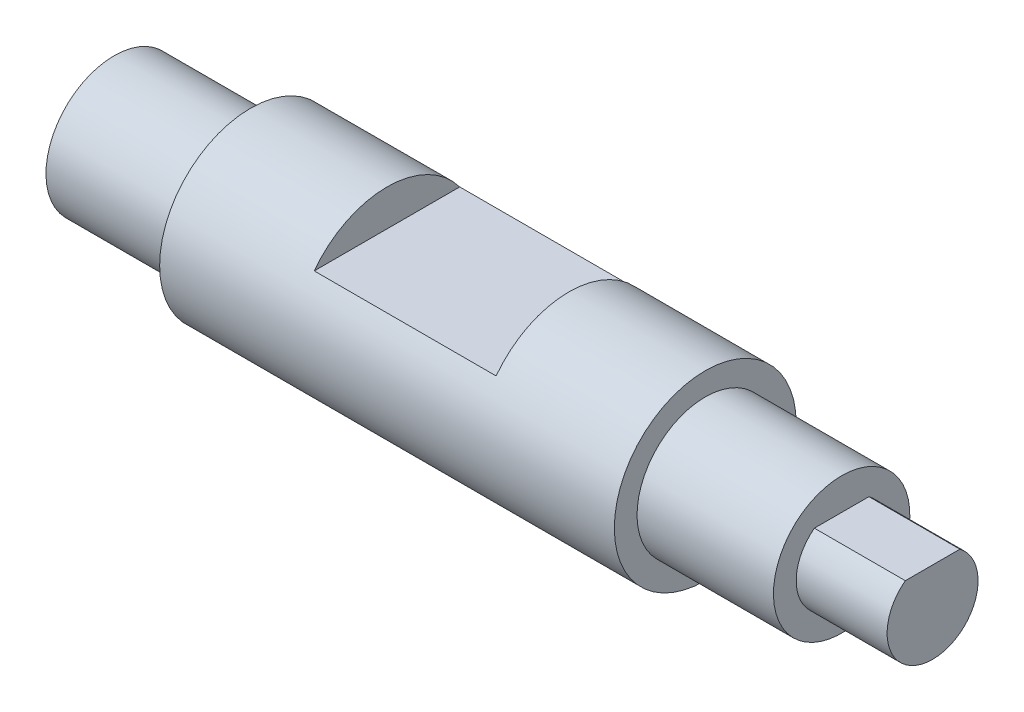
ISO-10303-21;
HEADER;
FILE_DESCRIPTION(('STEP AP214'),'2;1');
FILE_NAME('part.step','',(''),(''),'','','');
FILE_SCHEMA(('AUTOMOTIVE_DESIGN { 1 0 10303 214 1 1 1 1 }'));
ENDSEC;
DATA;
#1=APPLICATION_CONTEXT('core data for automotive mechanical design processes');
#2=APPLICATION_PROTOCOL_DEFINITION('international standard','automotive_design',2000,#1);
#3=PRODUCT_CONTEXT('',#1,'mechanical');
#4=PRODUCT('Part','Part','',(#3));
#5=PRODUCT_RELATED_PRODUCT_CATEGORY('part','',(#4));
#6=PRODUCT_DEFINITION_FORMATION('','',#4);
#7=PRODUCT_DEFINITION_CONTEXT('part definition',#1,'design');
#8=PRODUCT_DEFINITION('design','',#6,#7);
#9=PRODUCT_DEFINITION_SHAPE('','',#8);
#10=(LENGTH_UNIT() NAMED_UNIT(*) SI_UNIT(.MILLI.,.METRE.));
#11=(NAMED_UNIT(*) PLANE_ANGLE_UNIT() SI_UNIT($,.RADIAN.));
#12=(NAMED_UNIT(*) SI_UNIT($,.STERADIAN.) SOLID_ANGLE_UNIT());
#13=UNCERTAINTY_MEASURE_WITH_UNIT(LENGTH_MEASURE(1.E-05),#10,'distance_accuracy_value','');
#14=(GEOMETRIC_REPRESENTATION_CONTEXT(3) GLOBAL_UNCERTAINTY_ASSIGNED_CONTEXT((#13)) GLOBAL_UNIT_ASSIGNED_CONTEXT((#10,
#11,#12)) REPRESENTATION_CONTEXT('',''));
#15=CARTESIAN_POINT('',(0.,0.,0.));
#16=DIRECTION('',(0.,0.,1.));
#17=DIRECTION('',(1.,0.,0.));
#18=AXIS2_PLACEMENT_3D('',#15,#16,#17);
#19=CARTESIAN_POINT('',(0.,0.,0.));
#20=DIRECTION('',(-1.,0.,0.));
#21=DIRECTION('',(0.,-1.,0.));
#22=AXIS2_PLACEMENT_3D('',#19,#20,#21);
#23=PLANE('',#22);
#24=CARTESIAN_POINT('',(0.,0.,0.));
#25=DIRECTION('',(1.,0.,0.));
#26=DIRECTION('',(0.,1.,0.));
#27=AXIS2_PLACEMENT_3D('',#24,#25,#26);
#28=CIRCLE('',#27,7.5);
#29=CARTESIAN_POINT('',(0.,7.5,0.));
#30=VERTEX_POINT('',#29);
#31=EDGE_CURVE('E106',#30,#30,#28,.T.);
#32=ORIENTED_EDGE('',*,*,#31,.F.);
#33=EDGE_LOOP('',(#32));
#34=FACE_BOUND('',#33,.T.);
#35=ADVANCED_FACE('F32',(#34),#23,.T.);
#36=CARTESIAN_POINT('',(90.,0.,0.));
#37=DIRECTION('',(1.,0.,0.));
#38=DIRECTION('',(0.,1.,0.));
#39=AXIS2_PLACEMENT_3D('',#36,#37,#38);
#40=CYLINDRICAL_SURFACE('',#39,7.5);
#41=ORIENTED_EDGE('',*,*,#31,.T.);
#42=EDGE_LOOP('',(#41));
#43=FACE_BOUND('',#42,.T.);
#44=CARTESIAN_POINT('',(15.,0.,0.));
#45=DIRECTION('',(1.,0.,0.));
#46=DIRECTION('',(0.,1.,0.));
#47=AXIS2_PLACEMENT_3D('',#44,#45,#46);
#48=CIRCLE('',#47,7.5);
#49=CARTESIAN_POINT('',(15.,7.5,0.));
#50=VERTEX_POINT('',#49);
#51=EDGE_CURVE('E103',#50,#50,#48,.T.);
#52=ORIENTED_EDGE('',*,*,#51,.F.);
#53=EDGE_LOOP('',(#52));
#54=FACE_BOUND('',#53,.T.);
#55=ADVANCED_FACE('F141',(#43,#54),#40,.T.);
#56=CARTESIAN_POINT('',(15.,7.5,0.));
#57=DIRECTION('',(-1.,0.,0.));
#58=DIRECTION('',(0.,-1.,0.));
#59=AXIS2_PLACEMENT_3D('',#56,#57,#58);
#60=PLANE('',#59);
#61=ORIENTED_EDGE('',*,*,#51,.T.);
#62=EDGE_LOOP('',(#61));
#63=FACE_BOUND('',#62,.T.);
#64=CARTESIAN_POINT('',(15.,0.,0.));
#65=DIRECTION('',(1.,0.,0.));
#66=DIRECTION('',(0.,1.,0.));
#67=AXIS2_PLACEMENT_3D('',#64,#65,#66);
#68=CIRCLE('',#67,9.99999999999999);
#69=CARTESIAN_POINT('',(15.,9.99999999999999,0.));
#70=VERTEX_POINT('',#69);
#71=EDGE_CURVE('E100',#70,#70,#68,.T.);
#72=ORIENTED_EDGE('',*,*,#71,.F.);
#73=EDGE_LOOP('',(#72));
#74=FACE_BOUND('',#73,.T.);
#75=ADVANCED_FACE('F146',(#63,#74),#60,.T.);
#76=CARTESIAN_POINT('',(90.,0.,0.));
#77=DIRECTION('',(1.,0.,0.));
#78=DIRECTION('',(0.,1.,0.));
#79=AXIS2_PLACEMENT_3D('',#76,#77,#78);
#80=CYLINDRICAL_SURFACE('',#79,9.99999999999999);
#81=DIRECTION('',(1.,0.,0.));
#82=VECTOR('',#81,1.);
#83=CARTESIAN_POINT('',(90.,6.,-7.99999999999999));
#84=LINE('',#83,#82);
#85=CARTESIAN_POINT('',(50.,6.,-7.99999999999999));
#86=VERTEX_POINT('',#85);
#87=CARTESIAN_POINT('',(30.,6.,-7.99999999999999));
#88=VERTEX_POINT('',#87);
#89=EDGE_CURVE('E39',#86,#88,#84,.F.);
#90=ORIENTED_EDGE('',*,*,#89,.F.);
#91=CARTESIAN_POINT('',(50.,0.,0.));
#92=DIRECTION('',(1.,0.,0.));
#93=DIRECTION('',(0.,1.,0.));
#94=AXIS2_PLACEMENT_3D('',#91,#92,#93);
#95=CIRCLE('',#94,9.99999999999999);
#96=CARTESIAN_POINT('',(50.,6.,7.99999999999999));
#97=VERTEX_POINT('',#96);
#98=EDGE_CURVE('E111',#97,#86,#95,.F.);
#99=ORIENTED_EDGE('',*,*,#98,.F.);
#100=DIRECTION('',(1.,0.,0.));
#101=VECTOR('',#100,1.);
#102=CARTESIAN_POINT('',(90.,6.,7.99999999999999));
#103=LINE('',#102,#101);
#104=CARTESIAN_POINT('',(30.,6.,7.99999999999999));
#105=VERTEX_POINT('',#104);
#106=EDGE_CURVE('E109',#105,#97,#103,.T.);
#107=ORIENTED_EDGE('',*,*,#106,.F.);
#108=CARTESIAN_POINT('',(30.,0.,0.));
#109=DIRECTION('',(-1.,0.,0.));
#110=DIRECTION('',(0.,-1.,0.));
#111=AXIS2_PLACEMENT_3D('',#108,#109,#110);
#112=CIRCLE('',#111,9.99999999999999);
#113=EDGE_CURVE('E113',#88,#105,#112,.F.);
#114=ORIENTED_EDGE('',*,*,#113,.F.);
#115=EDGE_LOOP('',(#90,#99,#107,#114));
#116=FACE_BOUND('',#115,.T.);
#117=ORIENTED_EDGE('',*,*,#71,.T.);
#118=EDGE_LOOP('',(#117));
#119=FACE_BOUND('',#118,.T.);
#120=CARTESIAN_POINT('',(65.,0.,0.));
#121=DIRECTION('',(1.,0.,0.));
#122=DIRECTION('',(0.,1.,0.));
#123=AXIS2_PLACEMENT_3D('',#120,#121,#122);
#124=CIRCLE('',#123,9.99999999999999);
#125=CARTESIAN_POINT('',(65.,9.99999999999999,0.));
#126=VERTEX_POINT('',#125);
#127=EDGE_CURVE('E97',#126,#126,#124,.T.);
#128=ORIENTED_EDGE('',*,*,#127,.F.);
#129=EDGE_LOOP('',(#128));
#130=FACE_BOUND('',#129,.T.);
#131=ADVANCED_FACE('F124',(#116,#119,#130),#80,.T.);
#132=CARTESIAN_POINT('',(65.,9.99999999999999,0.));
#133=DIRECTION('',(1.,0.,0.));
#134=DIRECTION('',(0.,1.,0.));
#135=AXIS2_PLACEMENT_3D('',#132,#133,#134);
#136=PLANE('',#135);
#137=ORIENTED_EDGE('',*,*,#127,.T.);
#138=EDGE_LOOP('',(#137));
#139=FACE_BOUND('',#138,.T.);
#140=CARTESIAN_POINT('',(65.,0.,0.));
#141=DIRECTION('',(1.,0.,0.));
#142=DIRECTION('',(0.,1.,0.));
#143=AXIS2_PLACEMENT_3D('',#140,#141,#142);
#144=CIRCLE('',#143,7.5);
#145=CARTESIAN_POINT('',(65.,7.5,0.));
#146=VERTEX_POINT('',#145);
#147=EDGE_CURVE('E89',#146,#146,#144,.T.);
#148=ORIENTED_EDGE('',*,*,#147,.F.);
#149=EDGE_LOOP('',(#148));
#150=FACE_BOUND('',#149,.T.);
#151=ADVANCED_FACE('F158',(#139,#150),#136,.T.);
#152=CARTESIAN_POINT('',(90.,0.,0.));
#153=DIRECTION('',(1.,0.,0.));
#154=DIRECTION('',(0.,1.,0.));
#155=AXIS2_PLACEMENT_3D('',#152,#153,#154);
#156=CYLINDRICAL_SURFACE('',#155,7.5);
#157=ORIENTED_EDGE('',*,*,#147,.T.);
#158=EDGE_LOOP('',(#157));
#159=FACE_BOUND('',#158,.T.);
#160=CARTESIAN_POINT('',(80.,0.,0.));
#161=DIRECTION('',(1.,0.,0.));
#162=DIRECTION('',(0.,1.,0.));
#163=AXIS2_PLACEMENT_3D('',#160,#161,#162);
#164=CIRCLE('',#163,7.5);
#165=CARTESIAN_POINT('',(80.,7.5,0.));
#166=VERTEX_POINT('',#165);
#167=EDGE_CURVE('E85',#166,#166,#164,.T.);
#168=ORIENTED_EDGE('',*,*,#167,.F.);
#169=EDGE_LOOP('',(#168));
#170=FACE_BOUND('',#169,.T.);
#171=ADVANCED_FACE('F164',(#159,#170),#156,.T.);
#172=CARTESIAN_POINT('',(80.,7.5,0.));
#173=DIRECTION('',(1.,0.,0.));
#174=DIRECTION('',(0.,1.,0.));
#175=AXIS2_PLACEMENT_3D('',#172,#173,#174);
#176=PLANE('',#175);
#177=CARTESIAN_POINT('',(80.,0.,0.));
#178=DIRECTION('',(1.,0.,0.));
#179=DIRECTION('',(0.,1.,0.));
#180=AXIS2_PLACEMENT_3D('',#177,#178,#179);
#181=CIRCLE('',#180,5.);
#182=CARTESIAN_POINT('',(80.,4.,3.));
#183=VERTEX_POINT('',#182);
#184=CARTESIAN_POINT('',(80.,4.,-3.));
#185=VERTEX_POINT('',#184);
#186=EDGE_CURVE('E82',#183,#185,#181,.T.);
#187=ORIENTED_EDGE('',*,*,#186,.F.);
#188=DIRECTION('',(0.,0.,1.));
#189=VECTOR('',#188,1.);
#190=CARTESIAN_POINT('',(80.,4.,-30.));
#191=LINE('',#190,#189);
#192=EDGE_CURVE('E72',#185,#183,#191,.T.);
#193=ORIENTED_EDGE('',*,*,#192,.F.);
#194=EDGE_LOOP('',(#187,#193));
#195=FACE_BOUND('',#194,.T.);
#196=ORIENTED_EDGE('',*,*,#167,.T.);
#197=EDGE_LOOP('',(#196));
#198=FACE_BOUND('',#197,.T.);
#199=ADVANCED_FACE('F80',(#195,#198),#176,.T.);
#200=CARTESIAN_POINT('',(90.,0.,0.));
#201=DIRECTION('',(1.,0.,0.));
#202=DIRECTION('',(0.,1.,0.));
#203=AXIS2_PLACEMENT_3D('',#200,#201,#202);
#204=CYLINDRICAL_SURFACE('',#203,5.);
#205=DIRECTION('',(1.,0.,0.));
#206=VECTOR('',#205,1.);
#207=CARTESIAN_POINT('',(90.,4.,-3.));
#208=LINE('',#207,#206);
#209=CARTESIAN_POINT('',(90.,4.,-3.));
#210=VERTEX_POINT('',#209);
#211=EDGE_CURVE('E69',#210,#185,#208,.F.);
#212=ORIENTED_EDGE('',*,*,#211,.F.);
#213=CARTESIAN_POINT('',(90.,0.,0.));
#214=DIRECTION('',(1.,0.,0.));
#215=DIRECTION('',(0.,1.,0.));
#216=AXIS2_PLACEMENT_3D('',#213,#214,#215);
#217=CIRCLE('',#216,5.);
#218=CARTESIAN_POINT('',(90.,4.,3.));
#219=VERTEX_POINT('',#218);
#220=EDGE_CURVE('E86',#219,#210,#217,.T.);
#221=ORIENTED_EDGE('',*,*,#220,.F.);
#222=DIRECTION('',(1.,0.,0.));
#223=VECTOR('',#222,1.);
#224=CARTESIAN_POINT('',(90.,4.,3.));
#225=LINE('',#224,#223);
#226=EDGE_CURVE('E45',#183,#219,#225,.T.);
#227=ORIENTED_EDGE('',*,*,#226,.F.);
#228=ORIENTED_EDGE('',*,*,#186,.T.);
#229=EDGE_LOOP('',(#212,#221,#227,#228));
#230=FACE_BOUND('',#229,.T.);
#231=ADVANCED_FACE('F84',(#230),#204,.T.);
#232=CARTESIAN_POINT('',(90.,5.,0.));
#233=DIRECTION('',(1.,0.,0.));
#234=DIRECTION('',(0.,1.,0.));
#235=AXIS2_PLACEMENT_3D('',#232,#233,#234);
#236=PLANE('',#235);
#237=DIRECTION('',(0.,0.,-1.));
#238=VECTOR('',#237,1.);
#239=CARTESIAN_POINT('',(90.,4.,0.));
#240=LINE('',#239,#238);
#241=EDGE_CURVE('E11',#219,#210,#240,.T.);
#242=ORIENTED_EDGE('',*,*,#241,.F.);
#243=ORIENTED_EDGE('',*,*,#220,.T.);
#244=EDGE_LOOP('',(#242,#243));
#245=FACE_BOUND('',#244,.T.);
#246=ADVANCED_FACE('F137',(#245),#236,.T.);
#247=CARTESIAN_POINT('',(30.,14.9565187628756,-30.));
#248=DIRECTION('',(-1.,0.,0.));
#249=DIRECTION('',(0.,-1.,0.));
#250=AXIS2_PLACEMENT_3D('',#247,#248,#249);
#251=PLANE('',#250);
#252=ORIENTED_EDGE('',*,*,#113,.T.);
#253=DIRECTION('',(0.,0.,1.));
#254=VECTOR('',#253,1.);
#255=CARTESIAN_POINT('',(30.,6.,-30.));
#256=LINE('',#255,#254);
#257=EDGE_CURVE('E53',#88,#105,#256,.T.);
#258=ORIENTED_EDGE('',*,*,#257,.F.);
#259=EDGE_LOOP('',(#252,#258));
#260=FACE_BOUND('',#259,.T.);
#261=ADVANCED_FACE('F122',(#260),#251,.F.);
#262=CARTESIAN_POINT('',(50.,14.9565187628756,-30.));
#263=DIRECTION('',(1.,0.,0.));
#264=DIRECTION('',(0.,1.,0.));
#265=AXIS2_PLACEMENT_3D('',#262,#263,#264);
#266=PLANE('',#265);
#267=ORIENTED_EDGE('',*,*,#98,.T.);
#268=DIRECTION('',(0.,0.,1.));
#269=VECTOR('',#268,1.);
#270=CARTESIAN_POINT('',(50.,6.,-30.));
#271=LINE('',#270,#269);
#272=EDGE_CURVE('E91',#86,#97,#271,.T.);
#273=ORIENTED_EDGE('',*,*,#272,.T.);
#274=EDGE_LOOP('',(#267,#273));
#275=FACE_BOUND('',#274,.T.);
#276=ADVANCED_FACE('F127',(#275),#266,.F.);
#277=CARTESIAN_POINT('',(30.,6.,-30.));
#278=DIRECTION('',(0.,-1.,0.));
#279=DIRECTION('',(0.,0.,-1.));
#280=AXIS2_PLACEMENT_3D('',#277,#278,#279);
#281=PLANE('',#280);
#282=ORIENTED_EDGE('',*,*,#89,.T.);
#283=ORIENTED_EDGE('',*,*,#257,.T.);
#284=ORIENTED_EDGE('',*,*,#106,.T.);
#285=ORIENTED_EDGE('',*,*,#272,.F.);
#286=EDGE_LOOP('',(#282,#283,#284,#285));
#287=FACE_BOUND('',#286,.T.);
#288=ADVANCED_FACE('F116',(#287),#281,.F.);
#289=CARTESIAN_POINT('',(80.,4.,-30.));
#290=DIRECTION('',(0.,-1.,0.));
#291=DIRECTION('',(1.,0.,0.));
#292=AXIS2_PLACEMENT_3D('',#289,#290,#291);
#293=PLANE('',#292);
#294=ORIENTED_EDGE('',*,*,#211,.T.);
#295=ORIENTED_EDGE('',*,*,#192,.T.);
#296=ORIENTED_EDGE('',*,*,#226,.T.);
#297=ORIENTED_EDGE('',*,*,#241,.T.);
#298=EDGE_LOOP('',(#294,#295,#296,#297));
#299=FACE_BOUND('',#298,.T.);
#300=ADVANCED_FACE('F71',(#299),#293,.F.);
#301=CLOSED_SHELL('',(#35,#55,#75,#131,#151,#171,#199,#231,#246,#261,#276,#288,#300));
#302=MANIFOLD_SOLID_BREP('B2',#301);
#303=ADVANCED_BREP_SHAPE_REPRESENTATION('',(#18,#302),#14);
#304=SHAPE_DEFINITION_REPRESENTATION(#9,#303);
ENDSEC;
END-ISO-10303-21;
